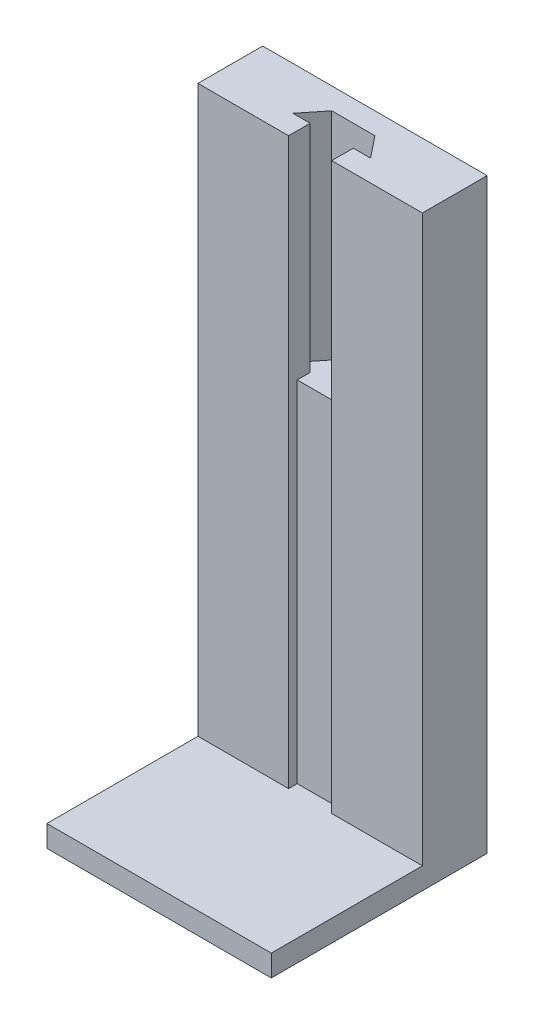
ISO-10303-21;
HEADER;
FILE_DESCRIPTION(('STEP AP214'),'2;1');
FILE_NAME('part.step','',(''),(''),'','','');
FILE_SCHEMA(('AUTOMOTIVE_DESIGN { 1 0 10303 214 1 1 1 1 }'));
ENDSEC;
DATA;
#1=APPLICATION_CONTEXT('core data for automotive mechanical design processes');
#2=APPLICATION_PROTOCOL_DEFINITION('international standard','automotive_design',2000,#1);
#3=PRODUCT_CONTEXT('',#1,'mechanical');
#4=PRODUCT('Part','Part','',(#3));
#5=PRODUCT_RELATED_PRODUCT_CATEGORY('part','',(#4));
#6=PRODUCT_DEFINITION_FORMATION('','',#4);
#7=PRODUCT_DEFINITION_CONTEXT('part definition',#1,'design');
#8=PRODUCT_DEFINITION('design','',#6,#7);
#9=PRODUCT_DEFINITION_SHAPE('','',#8);
#10=(LENGTH_UNIT() NAMED_UNIT(*) SI_UNIT(.MILLI.,.METRE.));
#11=(NAMED_UNIT(*) PLANE_ANGLE_UNIT() SI_UNIT($,.RADIAN.));
#12=(NAMED_UNIT(*) SI_UNIT($,.STERADIAN.) SOLID_ANGLE_UNIT());
#13=UNCERTAINTY_MEASURE_WITH_UNIT(LENGTH_MEASURE(1.E-05),#10,'distance_accuracy_value','');
#14=(GEOMETRIC_REPRESENTATION_CONTEXT(3) GLOBAL_UNCERTAINTY_ASSIGNED_CONTEXT((#13)) GLOBAL_UNIT_ASSIGNED_CONTEXT((#10,
#11,#12)) REPRESENTATION_CONTEXT('',''));
#15=CARTESIAN_POINT('',(0.,0.,0.));
#16=DIRECTION('',(0.,0.,1.));
#17=DIRECTION('',(1.,0.,0.));
#18=AXIS2_PLACEMENT_3D('',#15,#16,#17);
#19=CARTESIAN_POINT('',(-26.,136.,-10.));
#20=DIRECTION('',(0.,0.,-1.));
#21=DIRECTION('',(-1.,0.,0.));
#22=AXIS2_PLACEMENT_3D('',#19,#20,#21);
#23=PLANE('',#22);
#24=DIRECTION('',(1.,0.,0.));
#25=VECTOR('',#24,1.);
#26=CARTESIAN_POINT('',(-26.,5.,-10.));
#27=LINE('',#26,#25);
#28=CARTESIAN_POINT('',(-26.,5.,-10.));
#29=VERTEX_POINT('',#28);
#30=CARTESIAN_POINT('',(-5.,5.,-10.));
#31=VERTEX_POINT('',#30);
#32=EDGE_CURVE('E73',#29,#31,#27,.T.);
#33=ORIENTED_EDGE('',*,*,#32,.T.);
#34=DIRECTION('',(0.,1.,0.));
#35=VECTOR('',#34,1.);
#36=CARTESIAN_POINT('',(-5.,86.,-10.));
#37=LINE('',#36,#35);
#38=CARTESIAN_POINT('',(-5.,136.,-10.));
#39=VERTEX_POINT('',#38);
#40=EDGE_CURVE('E165',#31,#39,#37,.T.);
#41=ORIENTED_EDGE('',*,*,#40,.T.);
#42=DIRECTION('',(1.,0.,0.));
#43=VECTOR('',#42,1.);
#44=CARTESIAN_POINT('',(-26.,136.,-10.));
#45=LINE('',#44,#43);
#46=CARTESIAN_POINT('',(-26.,136.,-10.));
#47=VERTEX_POINT('',#46);
#48=EDGE_CURVE('E306',#47,#39,#45,.T.);
#49=ORIENTED_EDGE('',*,*,#48,.F.);
#50=DIRECTION('',(0.,-1.,0.));
#51=VECTOR('',#50,1.);
#52=CARTESIAN_POINT('',(-26.,136.,-10.));
#53=LINE('',#52,#51);
#54=EDGE_CURVE('E184',#47,#29,#53,.T.);
#55=ORIENTED_EDGE('',*,*,#54,.T.);
#56=EDGE_LOOP('',(#33,#41,#49,#55));
#57=FACE_BOUND('',#56,.T.);
#58=ADVANCED_FACE('F50',(#57),#23,.F.);
#59=CARTESIAN_POINT('',(0.,5.,0.));
#60=DIRECTION('',(0.,-1.,0.));
#61=DIRECTION('',(0.,0.,-1.));
#62=AXIS2_PLACEMENT_3D('',#59,#60,#61);
#63=PLANE('',#62);
#64=ORIENTED_EDGE('',*,*,#32,.F.);
#65=DIRECTION('',(0.,0.,1.));
#66=VECTOR('',#65,1.);
#67=CARTESIAN_POINT('',(-26.,5.,25.));
#68=LINE('',#67,#66);
#69=CARTESIAN_POINT('',(-26.,5.,25.));
#70=VERTEX_POINT('',#69);
#71=EDGE_CURVE('E204',#29,#70,#68,.T.);
#72=ORIENTED_EDGE('',*,*,#71,.T.);
#73=DIRECTION('',(1.,0.,0.));
#74=VECTOR('',#73,1.);
#75=CARTESIAN_POINT('',(-26.,5.,25.));
#76=LINE('',#75,#74);
#77=CARTESIAN_POINT('',(26.,5.,25.));
#78=VERTEX_POINT('',#77);
#79=EDGE_CURVE('E207',#70,#78,#76,.T.);
#80=ORIENTED_EDGE('',*,*,#79,.T.);
#81=DIRECTION('',(0.,0.,-1.));
#82=VECTOR('',#81,1.);
#83=CARTESIAN_POINT('',(26.,5.,25.));
#84=LINE('',#83,#82);
#85=CARTESIAN_POINT('',(26.,5.,-10.));
#86=VERTEX_POINT('',#85);
#87=EDGE_CURVE('E201',#78,#86,#84,.T.);
#88=ORIENTED_EDGE('',*,*,#87,.T.);
#89=CARTESIAN_POINT('',(5.,5.,-10.));
#90=VERTEX_POINT('',#89);
#91=EDGE_CURVE('E186',#90,#86,#27,.T.);
#92=ORIENTED_EDGE('',*,*,#91,.F.);
#93=DIRECTION('',(0.,0.,-1.));
#94=VECTOR('',#93,1.);
#95=CARTESIAN_POINT('',(5.,5.,-10.));
#96=LINE('',#95,#94);
#97=CARTESIAN_POINT('',(5.,5.,-12.));
#98=VERTEX_POINT('',#97);
#99=EDGE_CURVE('E179',#90,#98,#96,.T.);
#100=ORIENTED_EDGE('',*,*,#99,.T.);
#101=DIRECTION('',(-1.,0.,0.));
#102=VECTOR('',#101,1.);
#103=CARTESIAN_POINT('',(-5.,5.,-12.));
#104=LINE('',#103,#102);
#105=CARTESIAN_POINT('',(-5.,5.,-12.));
#106=VERTEX_POINT('',#105);
#107=EDGE_CURVE('E178',#98,#106,#104,.T.);
#108=ORIENTED_EDGE('',*,*,#107,.T.);
#109=DIRECTION('',(0.,0.,1.));
#110=VECTOR('',#109,1.);
#111=CARTESIAN_POINT('',(-5.,5.,-10.));
#112=LINE('',#111,#110);
#113=EDGE_CURVE('E167',#106,#31,#112,.T.);
#114=ORIENTED_EDGE('',*,*,#113,.T.);
#115=EDGE_LOOP('',(#64,#72,#80,#88,#92,#100,#108,#114));
#116=FACE_BOUND('',#115,.T.);
#117=ADVANCED_FACE('F175',(#116),#63,.F.);
#118=CARTESIAN_POINT('',(26.,5.,25.));
#119=DIRECTION('',(-1.,0.,0.));
#120=DIRECTION('',(0.,0.,1.));
#121=AXIS2_PLACEMENT_3D('',#118,#119,#120);
#122=PLANE('',#121);
#123=DIRECTION('',(0.,0.,-1.));
#124=VECTOR('',#123,1.);
#125=CARTESIAN_POINT('',(26.,0.,25.));
#126=LINE('',#125,#124);
#127=CARTESIAN_POINT('',(26.,0.,25.));
#128=VERTEX_POINT('',#127);
#129=CARTESIAN_POINT('',(26.,0.,-25.));
#130=VERTEX_POINT('',#129);
#131=EDGE_CURVE('E200',#128,#130,#126,.T.);
#132=ORIENTED_EDGE('',*,*,#131,.T.);
#133=DIRECTION('',(0.,-1.,0.));
#134=VECTOR('',#133,1.);
#135=CARTESIAN_POINT('',(26.,5.,-25.));
#136=LINE('',#135,#134);
#137=CARTESIAN_POINT('',(26.,136.,-25.));
#138=VERTEX_POINT('',#137);
#139=EDGE_CURVE('E12',#138,#130,#136,.T.);
#140=ORIENTED_EDGE('',*,*,#139,.F.);
#141=DIRECTION('',(0.,0.,-1.));
#142=VECTOR('',#141,1.);
#143=CARTESIAN_POINT('',(26.,136.,-25.));
#144=LINE('',#143,#142);
#145=CARTESIAN_POINT('',(26.,136.,-10.));
#146=VERTEX_POINT('',#145);
#147=EDGE_CURVE('E307',#146,#138,#144,.T.);
#148=ORIENTED_EDGE('',*,*,#147,.F.);
#149=DIRECTION('',(0.,-1.,0.));
#150=VECTOR('',#149,1.);
#151=CARTESIAN_POINT('',(26.,136.,-10.));
#152=LINE('',#151,#150);
#153=EDGE_CURVE('E196',#146,#86,#152,.T.);
#154=ORIENTED_EDGE('',*,*,#153,.T.);
#155=ORIENTED_EDGE('',*,*,#87,.F.);
#156=DIRECTION('',(0.,-1.,0.));
#157=VECTOR('',#156,1.);
#158=CARTESIAN_POINT('',(26.,5.,25.));
#159=LINE('',#158,#157);
#160=EDGE_CURVE('E209',#78,#128,#159,.T.);
#161=ORIENTED_EDGE('',*,*,#160,.T.);
#162=EDGE_LOOP('',(#132,#140,#148,#154,#155,#161));
#163=FACE_BOUND('',#162,.T.);
#164=ADVANCED_FACE('F52',(#163),#122,.F.);
#165=CARTESIAN_POINT('',(-26.,5.,-25.));
#166=DIRECTION('',(0.,0.,1.));
#167=DIRECTION('',(1.,0.,0.));
#168=AXIS2_PLACEMENT_3D('',#165,#166,#167);
#169=PLANE('',#168);
#170=DIRECTION('',(-1.,0.,0.));
#171=VECTOR('',#170,1.);
#172=CARTESIAN_POINT('',(-26.,0.,-25.));
#173=LINE('',#172,#171);
#174=CARTESIAN_POINT('',(-26.,0.,-25.));
#175=VERTEX_POINT('',#174);
#176=EDGE_CURVE('E212',#130,#175,#173,.T.);
#177=ORIENTED_EDGE('',*,*,#176,.T.);
#178=DIRECTION('',(0.,-1.,0.));
#179=VECTOR('',#178,1.);
#180=CARTESIAN_POINT('',(-26.,5.,-25.));
#181=LINE('',#180,#179);
#182=CARTESIAN_POINT('',(-26.,136.,-25.));
#183=VERTEX_POINT('',#182);
#184=EDGE_CURVE('E58',#183,#175,#181,.T.);
#185=ORIENTED_EDGE('',*,*,#184,.F.);
#186=DIRECTION('',(-1.,0.,0.));
#187=VECTOR('',#186,1.);
#188=CARTESIAN_POINT('',(-26.,136.,-25.));
#189=LINE('',#188,#187);
#190=EDGE_CURVE('E194',#138,#183,#189,.T.);
#191=ORIENTED_EDGE('',*,*,#190,.F.);
#192=ORIENTED_EDGE('',*,*,#139,.T.);
#193=EDGE_LOOP('',(#177,#185,#191,#192));
#194=FACE_BOUND('',#193,.T.);
#195=ADVANCED_FACE('F311',(#194),#169,.F.);
#196=CARTESIAN_POINT('',(-26.,5.,25.));
#197=DIRECTION('',(1.,0.,0.));
#198=DIRECTION('',(0.,0.,-1.));
#199=AXIS2_PLACEMENT_3D('',#196,#197,#198);
#200=PLANE('',#199);
#201=DIRECTION('',(0.,0.,1.));
#202=VECTOR('',#201,1.);
#203=CARTESIAN_POINT('',(-26.,0.,25.));
#204=LINE('',#203,#202);
#205=CARTESIAN_POINT('',(-26.,0.,25.));
#206=VERTEX_POINT('',#205);
#207=EDGE_CURVE('E214',#175,#206,#204,.T.);
#208=ORIENTED_EDGE('',*,*,#207,.T.);
#209=DIRECTION('',(0.,-1.,0.));
#210=VECTOR('',#209,1.);
#211=CARTESIAN_POINT('',(-26.,5.,25.));
#212=LINE('',#211,#210);
#213=EDGE_CURVE('E219',#70,#206,#212,.T.);
#214=ORIENTED_EDGE('',*,*,#213,.F.);
#215=ORIENTED_EDGE('',*,*,#71,.F.);
#216=ORIENTED_EDGE('',*,*,#54,.F.);
#217=DIRECTION('',(0.,0.,1.));
#218=VECTOR('',#217,1.);
#219=CARTESIAN_POINT('',(-26.,136.,-25.));
#220=LINE('',#219,#218);
#221=EDGE_CURVE('E185',#183,#47,#220,.T.);
#222=ORIENTED_EDGE('',*,*,#221,.F.);
#223=ORIENTED_EDGE('',*,*,#184,.T.);
#224=EDGE_LOOP('',(#208,#214,#215,#216,#222,#223));
#225=FACE_BOUND('',#224,.T.);
#226=ADVANCED_FACE('F225',(#225),#200,.F.);
#227=CARTESIAN_POINT('',(-26.,5.,25.));
#228=DIRECTION('',(0.,0.,-1.));
#229=DIRECTION('',(-1.,0.,0.));
#230=AXIS2_PLACEMENT_3D('',#227,#228,#229);
#231=PLANE('',#230);
#232=DIRECTION('',(1.,0.,0.));
#233=VECTOR('',#232,1.);
#234=CARTESIAN_POINT('',(-26.,0.,25.));
#235=LINE('',#234,#233);
#236=EDGE_CURVE('E205',#206,#128,#235,.T.);
#237=ORIENTED_EDGE('',*,*,#236,.T.);
#238=ORIENTED_EDGE('',*,*,#160,.F.);
#239=ORIENTED_EDGE('',*,*,#79,.F.);
#240=ORIENTED_EDGE('',*,*,#213,.T.);
#241=EDGE_LOOP('',(#237,#238,#239,#240));
#242=FACE_BOUND('',#241,.T.);
#243=ADVANCED_FACE('F236',(#242),#231,.F.);
#244=CARTESIAN_POINT('',(0.,0.,0.));
#245=DIRECTION('',(0.,-1.,0.));
#246=DIRECTION('',(0.,0.,-1.));
#247=AXIS2_PLACEMENT_3D('',#244,#245,#246);
#248=PLANE('',#247);
#249=ORIENTED_EDGE('',*,*,#131,.F.);
#250=ORIENTED_EDGE('',*,*,#236,.F.);
#251=ORIENTED_EDGE('',*,*,#207,.F.);
#252=ORIENTED_EDGE('',*,*,#176,.F.);
#253=EDGE_LOOP('',(#249,#250,#251,#252));
#254=FACE_BOUND('',#253,.T.);
#255=ADVANCED_FACE('F233',(#254),#248,.T.);
#256=DIRECTION('',(0.,1.,0.));
#257=VECTOR('',#256,1.);
#258=CARTESIAN_POINT('',(5.,86.,-10.));
#259=LINE('',#258,#257);
#260=CARTESIAN_POINT('',(4.99999999999999,136.,-10.));
#261=VERTEX_POINT('',#260);
#262=EDGE_CURVE('E65',#90,#261,#259,.T.);
#263=ORIENTED_EDGE('',*,*,#262,.F.);
#264=ORIENTED_EDGE('',*,*,#91,.T.);
#265=ORIENTED_EDGE('',*,*,#153,.F.);
#266=EDGE_CURVE('E189',#261,#146,#45,.T.);
#267=ORIENTED_EDGE('',*,*,#266,.F.);
#268=EDGE_LOOP('',(#263,#264,#265,#267));
#269=FACE_BOUND('',#268,.T.);
#270=ADVANCED_FACE('F244',(#269),#23,.F.);
#271=CARTESIAN_POINT('',(0.,136.,0.));
#272=DIRECTION('',(0.,1.,0.));
#273=DIRECTION('',(0.,0.,1.));
#274=AXIS2_PLACEMENT_3D('',#271,#272,#273);
#275=PLANE('',#274);
#276=DIRECTION('',(0.,0.,1.));
#277=VECTOR('',#276,1.);
#278=CARTESIAN_POINT('',(-5.,136.,-15.));
#279=LINE('',#278,#277);
#280=CARTESIAN_POINT('',(-5.,136.,-15.));
#281=VERTEX_POINT('',#280);
#282=EDGE_CURVE('E170',#281,#39,#279,.T.);
#283=ORIENTED_EDGE('',*,*,#282,.F.);
#284=DIRECTION('',(1.,0.,0.));
#285=VECTOR('',#284,1.);
#286=CARTESIAN_POINT('',(-9.,136.,-15.));
#287=LINE('',#286,#285);
#288=CARTESIAN_POINT('',(-9.,136.,-15.));
#289=VERTEX_POINT('',#288);
#290=EDGE_CURVE('E263',#289,#281,#287,.T.);
#291=ORIENTED_EDGE('',*,*,#290,.F.);
#292=DIRECTION('',(-0.624695047554424,0.,0.78086880944303));
#293=VECTOR('',#292,1.);
#294=CARTESIAN_POINT('',(-5.,136.,-20.));
#295=LINE('',#294,#293);
#296=CARTESIAN_POINT('',(-5.,136.,-20.));
#297=VERTEX_POINT('',#296);
#298=EDGE_CURVE('E291',#297,#289,#295,.T.);
#299=ORIENTED_EDGE('',*,*,#298,.F.);
#300=DIRECTION('',(-1.,0.,0.));
#301=VECTOR('',#300,1.);
#302=CARTESIAN_POINT('',(5.,136.,-20.));
#303=LINE('',#302,#301);
#304=CARTESIAN_POINT('',(5.,136.,-20.));
#305=VERTEX_POINT('',#304);
#306=EDGE_CURVE('E288',#305,#297,#303,.T.);
#307=ORIENTED_EDGE('',*,*,#306,.F.);
#308=DIRECTION('',(-0.624695047554425,0.,-0.78086880944303));
#309=VECTOR('',#308,1.);
#310=CARTESIAN_POINT('',(9.,136.,-15.));
#311=LINE('',#310,#309);
#312=CARTESIAN_POINT('',(9.,136.,-15.));
#313=VERTEX_POINT('',#312);
#314=EDGE_CURVE('E285',#313,#305,#311,.T.);
#315=ORIENTED_EDGE('',*,*,#314,.F.);
#316=DIRECTION('',(1.,0.,0.));
#317=VECTOR('',#316,1.);
#318=CARTESIAN_POINT('',(5.,136.,-15.));
#319=LINE('',#318,#317);
#320=CARTESIAN_POINT('',(5.,136.,-15.));
#321=VERTEX_POINT('',#320);
#322=EDGE_CURVE('E282',#321,#313,#319,.T.);
#323=ORIENTED_EDGE('',*,*,#322,.F.);
#324=DIRECTION('',(0.,0.,-1.));
#325=VECTOR('',#324,1.);
#326=CARTESIAN_POINT('',(5.,136.,-10.));
#327=LINE('',#326,#325);
#328=EDGE_CURVE('E280',#261,#321,#327,.T.);
#329=ORIENTED_EDGE('',*,*,#328,.F.);
#330=ORIENTED_EDGE('',*,*,#266,.T.);
#331=ORIENTED_EDGE('',*,*,#147,.T.);
#332=ORIENTED_EDGE('',*,*,#190,.T.);
#333=ORIENTED_EDGE('',*,*,#221,.T.);
#334=ORIENTED_EDGE('',*,*,#48,.T.);
#335=EDGE_LOOP('',(#283,#291,#299,#307,#315,#323,#329,#330,#331,#332,#333,#334));
#336=FACE_BOUND('',#335,.T.);
#337=ADVANCED_FACE('F310',(#336),#275,.T.);
#338=CARTESIAN_POINT('',(-5.,86.,-15.));
#339=DIRECTION('',(-1.,0.,0.));
#340=DIRECTION('',(0.,0.,1.));
#341=AXIS2_PLACEMENT_3D('',#338,#339,#340);
#342=PLANE('',#341);
#343=ORIENTED_EDGE('',*,*,#282,.T.);
#344=ORIENTED_EDGE('',*,*,#40,.F.);
#345=ORIENTED_EDGE('',*,*,#113,.F.);
#346=DIRECTION('',(0.,1.,0.));
#347=VECTOR('',#346,1.);
#348=CARTESIAN_POINT('',(-5.,5.,-12.));
#349=LINE('',#348,#347);
#350=CARTESIAN_POINT('',(-5.,86.,-12.));
#351=VERTEX_POINT('',#350);
#352=EDGE_CURVE('E256',#106,#351,#349,.T.);
#353=ORIENTED_EDGE('',*,*,#352,.T.);
#354=DIRECTION('',(0.,0.,1.));
#355=VECTOR('',#354,1.);
#356=CARTESIAN_POINT('',(-5.,86.,-15.));
#357=LINE('',#356,#355);
#358=CARTESIAN_POINT('',(-5.,86.,-15.));
#359=VERTEX_POINT('',#358);
#360=EDGE_CURVE('E259',#359,#351,#357,.T.);
#361=ORIENTED_EDGE('',*,*,#360,.F.);
#362=DIRECTION('',(0.,1.,0.));
#363=VECTOR('',#362,1.);
#364=CARTESIAN_POINT('',(-5.,86.,-15.));
#365=LINE('',#364,#363);
#366=EDGE_CURVE('E191',#359,#281,#365,.T.);
#367=ORIENTED_EDGE('',*,*,#366,.T.);
#368=EDGE_LOOP('',(#343,#344,#345,#353,#361,#367));
#369=FACE_BOUND('',#368,.T.);
#370=ADVANCED_FACE('F166',(#369),#342,.F.);
#371=CARTESIAN_POINT('',(-9.,86.,-15.));
#372=DIRECTION('',(0.,0.,1.));
#373=DIRECTION('',(1.,0.,0.));
#374=AXIS2_PLACEMENT_3D('',#371,#372,#373);
#375=PLANE('',#374);
#376=ORIENTED_EDGE('',*,*,#290,.T.);
#377=ORIENTED_EDGE('',*,*,#366,.F.);
#378=DIRECTION('',(1.,0.,0.));
#379=VECTOR('',#378,1.);
#380=CARTESIAN_POINT('',(-9.,86.,-15.));
#381=LINE('',#380,#379);
#382=CARTESIAN_POINT('',(-9.,86.,-15.));
#383=VERTEX_POINT('',#382);
#384=EDGE_CURVE('E173',#383,#359,#381,.T.);
#385=ORIENTED_EDGE('',*,*,#384,.F.);
#386=DIRECTION('',(0.,1.,0.));
#387=VECTOR('',#386,1.);
#388=CARTESIAN_POINT('',(-9.,86.,-15.));
#389=LINE('',#388,#387);
#390=EDGE_CURVE('E297',#383,#289,#389,.T.);
#391=ORIENTED_EDGE('',*,*,#390,.T.);
#392=EDGE_LOOP('',(#376,#377,#385,#391));
#393=FACE_BOUND('',#392,.T.);
#394=ADVANCED_FACE('F392',(#393),#375,.F.);
#395=CARTESIAN_POINT('',(-5.,86.,-20.));
#396=DIRECTION('',(-0.78086880944303,0.,-0.624695047554424));
#397=DIRECTION('',(-0.624695047554424,0.,0.78086880944303));
#398=AXIS2_PLACEMENT_3D('',#395,#396,#397);
#399=PLANE('',#398);
#400=ORIENTED_EDGE('',*,*,#298,.T.);
#401=ORIENTED_EDGE('',*,*,#390,.F.);
#402=DIRECTION('',(-0.624695047554424,0.,0.78086880944303));
#403=VECTOR('',#402,1.);
#404=CARTESIAN_POINT('',(-5.,86.,-20.));
#405=LINE('',#404,#403);
#406=CARTESIAN_POINT('',(-5.,86.,-20.));
#407=VERTEX_POINT('',#406);
#408=EDGE_CURVE('E274',#407,#383,#405,.T.);
#409=ORIENTED_EDGE('',*,*,#408,.F.);
#410=DIRECTION('',(0.,1.,0.));
#411=VECTOR('',#410,1.);
#412=CARTESIAN_POINT('',(-5.,86.,-20.));
#413=LINE('',#412,#411);
#414=EDGE_CURVE('E299',#407,#297,#413,.T.);
#415=ORIENTED_EDGE('',*,*,#414,.T.);
#416=EDGE_LOOP('',(#400,#401,#409,#415));
#417=FACE_BOUND('',#416,.T.);
#418=ADVANCED_FACE('F402',(#417),#399,.F.);
#419=CARTESIAN_POINT('',(5.,86.,-20.));
#420=DIRECTION('',(0.,0.,-1.));
#421=DIRECTION('',(-1.,0.,0.));
#422=AXIS2_PLACEMENT_3D('',#419,#420,#421);
#423=PLANE('',#422);
#424=ORIENTED_EDGE('',*,*,#306,.T.);
#425=ORIENTED_EDGE('',*,*,#414,.F.);
#426=DIRECTION('',(-1.,0.,0.));
#427=VECTOR('',#426,1.);
#428=CARTESIAN_POINT('',(5.,86.,-20.));
#429=LINE('',#428,#427);
#430=CARTESIAN_POINT('',(5.,86.,-20.));
#431=VERTEX_POINT('',#430);
#432=EDGE_CURVE('E271',#431,#407,#429,.T.);
#433=ORIENTED_EDGE('',*,*,#432,.F.);
#434=DIRECTION('',(0.,1.,0.));
#435=VECTOR('',#434,1.);
#436=CARTESIAN_POINT('',(5.,86.,-20.));
#437=LINE('',#436,#435);
#438=EDGE_CURVE('E301',#431,#305,#437,.T.);
#439=ORIENTED_EDGE('',*,*,#438,.T.);
#440=EDGE_LOOP('',(#424,#425,#433,#439));
#441=FACE_BOUND('',#440,.T.);
#442=ADVANCED_FACE('F412',(#441),#423,.F.);
#443=CARTESIAN_POINT('',(9.,86.,-15.));
#444=DIRECTION('',(0.78086880944303,0.,-0.624695047554425));
#445=DIRECTION('',(-0.624695047554425,0.,-0.78086880944303));
#446=AXIS2_PLACEMENT_3D('',#443,#444,#445);
#447=PLANE('',#446);
#448=ORIENTED_EDGE('',*,*,#314,.T.);
#449=ORIENTED_EDGE('',*,*,#438,.F.);
#450=DIRECTION('',(-0.624695047554425,0.,-0.78086880944303));
#451=VECTOR('',#450,1.);
#452=CARTESIAN_POINT('',(9.,86.,-15.));
#453=LINE('',#452,#451);
#454=CARTESIAN_POINT('',(9.,86.,-15.));
#455=VERTEX_POINT('',#454);
#456=EDGE_CURVE('E268',#455,#431,#453,.T.);
#457=ORIENTED_EDGE('',*,*,#456,.F.);
#458=DIRECTION('',(0.,1.,0.));
#459=VECTOR('',#458,1.);
#460=CARTESIAN_POINT('',(9.,86.,-15.));
#461=LINE('',#460,#459);
#462=EDGE_CURVE('E303',#455,#313,#461,.T.);
#463=ORIENTED_EDGE('',*,*,#462,.T.);
#464=EDGE_LOOP('',(#448,#449,#457,#463));
#465=FACE_BOUND('',#464,.T.);
#466=ADVANCED_FACE('F422',(#465),#447,.F.);
#467=CARTESIAN_POINT('',(5.,86.,-15.));
#468=DIRECTION('',(0.,0.,1.));
#469=DIRECTION('',(1.,0.,0.));
#470=AXIS2_PLACEMENT_3D('',#467,#468,#469);
#471=PLANE('',#470);
#472=ORIENTED_EDGE('',*,*,#322,.T.);
#473=ORIENTED_EDGE('',*,*,#462,.F.);
#474=DIRECTION('',(1.,0.,0.));
#475=VECTOR('',#474,1.);
#476=CARTESIAN_POINT('',(5.,86.,-15.));
#477=LINE('',#476,#475);
#478=CARTESIAN_POINT('',(5.,86.,-15.));
#479=VERTEX_POINT('',#478);
#480=EDGE_CURVE('E265',#479,#455,#477,.T.);
#481=ORIENTED_EDGE('',*,*,#480,.F.);
#482=DIRECTION('',(0.,1.,0.));
#483=VECTOR('',#482,1.);
#484=CARTESIAN_POINT('',(5.,86.,-15.));
#485=LINE('',#484,#483);
#486=EDGE_CURVE('E246',#479,#321,#485,.T.);
#487=ORIENTED_EDGE('',*,*,#486,.T.);
#488=EDGE_LOOP('',(#472,#473,#481,#487));
#489=FACE_BOUND('',#488,.T.);
#490=ADVANCED_FACE('F432',(#489),#471,.F.);
#491=CARTESIAN_POINT('',(5.,86.,-10.));
#492=DIRECTION('',(1.,0.,0.));
#493=DIRECTION('',(0.,0.,-1.));
#494=AXIS2_PLACEMENT_3D('',#491,#492,#493);
#495=PLANE('',#494);
#496=ORIENTED_EDGE('',*,*,#328,.T.);
#497=ORIENTED_EDGE('',*,*,#486,.F.);
#498=DIRECTION('',(0.,0.,-1.));
#499=VECTOR('',#498,1.);
#500=CARTESIAN_POINT('',(5.,86.,-10.));
#501=LINE('',#500,#499);
#502=CARTESIAN_POINT('',(5.,86.,-12.));
#503=VERTEX_POINT('',#502);
#504=EDGE_CURVE('E262',#503,#479,#501,.T.);
#505=ORIENTED_EDGE('',*,*,#504,.F.);
#506=DIRECTION('',(0.,1.,0.));
#507=VECTOR('',#506,1.);
#508=CARTESIAN_POINT('',(5.,5.,-12.));
#509=LINE('',#508,#507);
#510=EDGE_CURVE('E250',#98,#503,#509,.T.);
#511=ORIENTED_EDGE('',*,*,#510,.F.);
#512=ORIENTED_EDGE('',*,*,#99,.F.);
#513=ORIENTED_EDGE('',*,*,#262,.T.);
#514=EDGE_LOOP('',(#496,#497,#505,#511,#512,#513));
#515=FACE_BOUND('',#514,.T.);
#516=ADVANCED_FACE('F248',(#515),#495,.F.);
#517=CARTESIAN_POINT('',(0.,86.,0.));
#518=DIRECTION('',(0.,1.,0.));
#519=DIRECTION('',(0.,0.,1.));
#520=AXIS2_PLACEMENT_3D('',#517,#518,#519);
#521=PLANE('',#520);
#522=DIRECTION('',(-1.,0.,0.));
#523=VECTOR('',#522,1.);
#524=CARTESIAN_POINT('',(-5.,86.,-12.));
#525=LINE('',#524,#523);
#526=EDGE_CURVE('E180',#503,#351,#525,.T.);
#527=ORIENTED_EDGE('',*,*,#526,.F.);
#528=ORIENTED_EDGE('',*,*,#504,.T.);
#529=ORIENTED_EDGE('',*,*,#480,.T.);
#530=ORIENTED_EDGE('',*,*,#456,.T.);
#531=ORIENTED_EDGE('',*,*,#432,.T.);
#532=ORIENTED_EDGE('',*,*,#408,.T.);
#533=ORIENTED_EDGE('',*,*,#384,.T.);
#534=ORIENTED_EDGE('',*,*,#360,.T.);
#535=EDGE_LOOP('',(#527,#528,#529,#530,#531,#532,#533,#534));
#536=FACE_BOUND('',#535,.T.);
#537=ADVANCED_FACE('F450',(#536),#521,.T.);
#538=CARTESIAN_POINT('',(-5.,5.,-12.));
#539=DIRECTION('',(0.,0.,-1.));
#540=DIRECTION('',(-1.,0.,0.));
#541=AXIS2_PLACEMENT_3D('',#538,#539,#540);
#542=PLANE('',#541);
#543=ORIENTED_EDGE('',*,*,#526,.T.);
#544=ORIENTED_EDGE('',*,*,#352,.F.);
#545=ORIENTED_EDGE('',*,*,#107,.F.);
#546=ORIENTED_EDGE('',*,*,#510,.T.);
#547=EDGE_LOOP('',(#543,#544,#545,#546));
#548=FACE_BOUND('',#547,.T.);
#549=ADVANCED_FACE('F461',(#548),#542,.F.);
#550=CLOSED_SHELL('',(#58,#117,#164,#195,#226,#243,#255,#270,#337,#370,#394,#418,#442,#466,#490,
#516,#537,#549));
#551=MANIFOLD_SOLID_BREP('B2',#550);
#552=ADVANCED_BREP_SHAPE_REPRESENTATION('',(#18,#551),#14);
#553=SHAPE_DEFINITION_REPRESENTATION(#9,#552);
ENDSEC;
END-ISO-10303-21;
